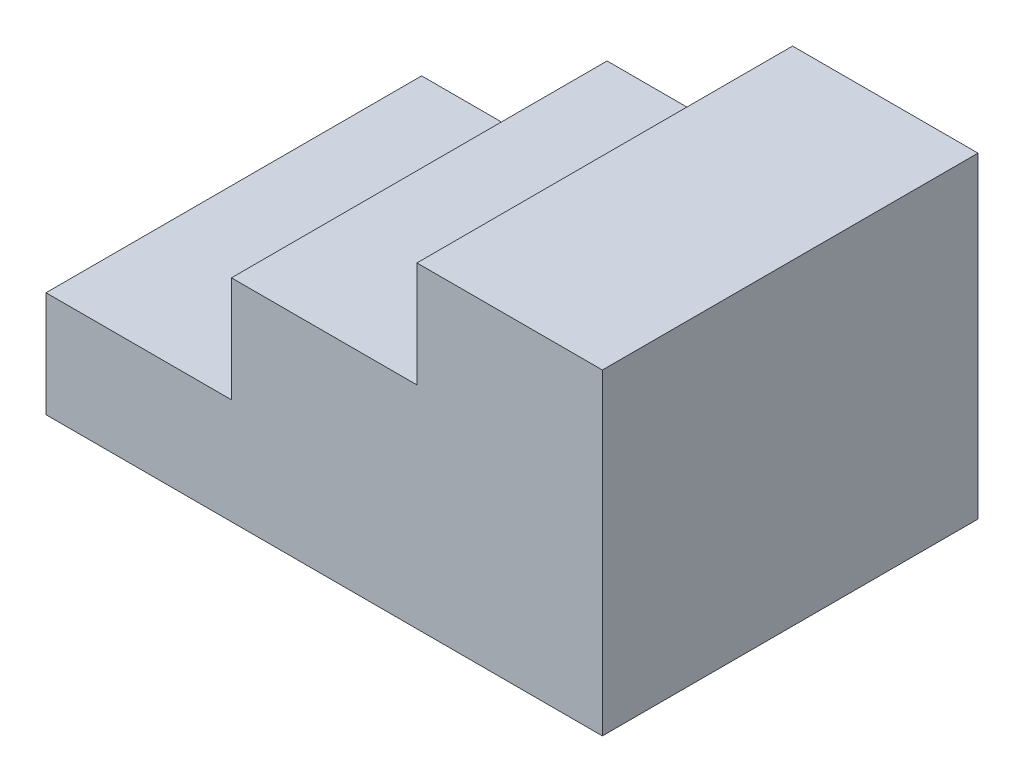
ISO-10303-21;
HEADER;
FILE_DESCRIPTION(('STEP AP214'),'2;1');
FILE_NAME('part.step','',(''),(''),'','','');
FILE_SCHEMA(('AUTOMOTIVE_DESIGN { 1 0 10303 214 1 1 1 1 }'));
ENDSEC;
DATA;
#1=APPLICATION_CONTEXT('core data for automotive mechanical design processes');
#2=APPLICATION_PROTOCOL_DEFINITION('international standard','automotive_design',2000,#1);
#3=PRODUCT_CONTEXT('',#1,'mechanical');
#4=PRODUCT('Part','Part','',(#3));
#5=PRODUCT_RELATED_PRODUCT_CATEGORY('part','',(#4));
#6=PRODUCT_DEFINITION_FORMATION('','',#4);
#7=PRODUCT_DEFINITION_CONTEXT('part definition',#1,'design');
#8=PRODUCT_DEFINITION('design','',#6,#7);
#9=PRODUCT_DEFINITION_SHAPE('','',#8);
#10=(LENGTH_UNIT() NAMED_UNIT(*) SI_UNIT(.MILLI.,.METRE.));
#11=(NAMED_UNIT(*) PLANE_ANGLE_UNIT() SI_UNIT($,.RADIAN.));
#12=(NAMED_UNIT(*) SI_UNIT($,.STERADIAN.) SOLID_ANGLE_UNIT());
#13=UNCERTAINTY_MEASURE_WITH_UNIT(LENGTH_MEASURE(1.E-05),#10,'distance_accuracy_value','');
#14=(GEOMETRIC_REPRESENTATION_CONTEXT(3) GLOBAL_UNCERTAINTY_ASSIGNED_CONTEXT((#13)) GLOBAL_UNIT_ASSIGNED_CONTEXT((#10,
#11,#12)) REPRESENTATION_CONTEXT('',''));
#15=CARTESIAN_POINT('',(0.,0.,0.));
#16=DIRECTION('',(0.,0.,1.));
#17=DIRECTION('',(1.,0.,0.));
#18=AXIS2_PLACEMENT_3D('',#15,#16,#17);
#19=CARTESIAN_POINT('',(0.,171.45,609.6));
#20=DIRECTION('',(1.,0.,0.));
#21=DIRECTION('',(0.,0.,-1.));
#22=AXIS2_PLACEMENT_3D('',#19,#20,#21);
#23=PLANE('',#22);
#24=DIRECTION('',(0.,-1.,0.));
#25=VECTOR('',#24,1.);
#26=CARTESIAN_POINT('',(0.,171.45,0.));
#27=LINE('',#26,#25);
#28=CARTESIAN_POINT('',(0.,171.45,0.));
#29=VERTEX_POINT('',#28);
#30=CARTESIAN_POINT('',(0.,0.,0.));
#31=VERTEX_POINT('',#30);
#32=EDGE_CURVE('E129',#29,#31,#27,.T.);
#33=ORIENTED_EDGE('',*,*,#32,.T.);
#34=DIRECTION('',(0.,0.,-1.));
#35=VECTOR('',#34,1.);
#36=CARTESIAN_POINT('',(0.,0.,609.6));
#37=LINE('',#36,#35);
#38=CARTESIAN_POINT('',(0.,0.,609.6));
#39=VERTEX_POINT('',#38);
#40=EDGE_CURVE('E11',#39,#31,#37,.T.);
#41=ORIENTED_EDGE('',*,*,#40,.F.);
#42=DIRECTION('',(0.,-1.,0.));
#43=VECTOR('',#42,1.);
#44=CARTESIAN_POINT('',(0.,171.45,609.6));
#45=LINE('',#44,#43);
#46=CARTESIAN_POINT('',(0.,171.45,609.6));
#47=VERTEX_POINT('',#46);
#48=EDGE_CURVE('E143',#47,#39,#45,.T.);
#49=ORIENTED_EDGE('',*,*,#48,.F.);
#50=DIRECTION('',(0.,0.,-1.));
#51=VECTOR('',#50,1.);
#52=CARTESIAN_POINT('',(0.,171.45,609.6));
#53=LINE('',#52,#51);
#54=EDGE_CURVE('E125',#47,#29,#53,.T.);
#55=ORIENTED_EDGE('',*,*,#54,.T.);
#56=EDGE_LOOP('',(#33,#41,#49,#55));
#57=FACE_BOUND('',#56,.T.);
#58=ADVANCED_FACE('F33',(#57),#23,.F.);
#59=CARTESIAN_POINT('',(0.,0.,609.6));
#60=DIRECTION('',(0.,1.,0.));
#61=DIRECTION('',(0.,0.,1.));
#62=AXIS2_PLACEMENT_3D('',#59,#60,#61);
#63=PLANE('',#62);
#64=DIRECTION('',(1.,0.,0.));
#65=VECTOR('',#64,1.);
#66=CARTESIAN_POINT('',(0.,0.,0.));
#67=LINE('',#66,#65);
#68=CARTESIAN_POINT('',(902.97,0.,0.));
#69=VERTEX_POINT('',#68);
#70=EDGE_CURVE('E132',#31,#69,#67,.T.);
#71=ORIENTED_EDGE('',*,*,#70,.T.);
#72=DIRECTION('',(0.,0.,-1.));
#73=VECTOR('',#72,1.);
#74=CARTESIAN_POINT('',(902.97,0.,609.6));
#75=LINE('',#74,#73);
#76=CARTESIAN_POINT('',(902.97,0.,609.6));
#77=VERTEX_POINT('',#76);
#78=EDGE_CURVE('E41',#77,#69,#75,.T.);
#79=ORIENTED_EDGE('',*,*,#78,.F.);
#80=DIRECTION('',(1.,0.,0.));
#81=VECTOR('',#80,1.);
#82=CARTESIAN_POINT('',(0.,0.,609.6));
#83=LINE('',#82,#81);
#84=EDGE_CURVE('E92',#39,#77,#83,.T.);
#85=ORIENTED_EDGE('',*,*,#84,.F.);
#86=ORIENTED_EDGE('',*,*,#40,.T.);
#87=EDGE_LOOP('',(#71,#79,#85,#86));
#88=FACE_BOUND('',#87,.T.);
#89=ADVANCED_FACE('F178',(#88),#63,.F.);
#90=CARTESIAN_POINT('',(902.97,0.,609.6));
#91=DIRECTION('',(-1.,0.,0.));
#92=DIRECTION('',(0.,-1.,0.));
#93=AXIS2_PLACEMENT_3D('',#90,#91,#92);
#94=PLANE('',#93);
#95=DIRECTION('',(0.,1.,0.));
#96=VECTOR('',#95,1.);
#97=CARTESIAN_POINT('',(902.97,0.,0.));
#98=LINE('',#97,#96);
#99=CARTESIAN_POINT('',(902.97,514.35,0.));
#100=VERTEX_POINT('',#99);
#101=EDGE_CURVE('E134',#69,#100,#98,.T.);
#102=ORIENTED_EDGE('',*,*,#101,.T.);
#103=DIRECTION('',(0.,0.,-1.));
#104=VECTOR('',#103,1.);
#105=CARTESIAN_POINT('',(902.97,514.35,609.6));
#106=LINE('',#105,#104);
#107=CARTESIAN_POINT('',(902.97,514.35,609.6));
#108=VERTEX_POINT('',#107);
#109=EDGE_CURVE('E150',#108,#100,#106,.T.);
#110=ORIENTED_EDGE('',*,*,#109,.F.);
#111=DIRECTION('',(0.,1.,0.));
#112=VECTOR('',#111,1.);
#113=CARTESIAN_POINT('',(902.97,0.,609.6));
#114=LINE('',#113,#112);
#115=EDGE_CURVE('E158',#77,#108,#114,.T.);
#116=ORIENTED_EDGE('',*,*,#115,.F.);
#117=ORIENTED_EDGE('',*,*,#78,.T.);
#118=EDGE_LOOP('',(#102,#110,#116,#117));
#119=FACE_BOUND('',#118,.T.);
#120=ADVANCED_FACE('F156',(#119),#94,.F.);
#121=CARTESIAN_POINT('',(902.97,514.35,609.6));
#122=DIRECTION('',(0.,-1.,0.));
#123=DIRECTION('',(1.,0.,0.));
#124=AXIS2_PLACEMENT_3D('',#121,#122,#123);
#125=PLANE('',#124);
#126=DIRECTION('',(-1.,0.,0.));
#127=VECTOR('',#126,1.);
#128=CARTESIAN_POINT('',(902.97,514.35,0.));
#129=LINE('',#128,#127);
#130=CARTESIAN_POINT('',(601.98,514.35,0.));
#131=VERTEX_POINT('',#130);
#132=EDGE_CURVE('E136',#100,#131,#129,.T.);
#133=ORIENTED_EDGE('',*,*,#132,.T.);
#134=DIRECTION('',(0.,0.,-1.));
#135=VECTOR('',#134,1.);
#136=CARTESIAN_POINT('',(601.98,514.35,609.6));
#137=LINE('',#136,#135);
#138=CARTESIAN_POINT('',(601.98,514.35,609.6));
#139=VERTEX_POINT('',#138);
#140=EDGE_CURVE('E147',#139,#131,#137,.T.);
#141=ORIENTED_EDGE('',*,*,#140,.F.);
#142=DIRECTION('',(-1.,0.,0.));
#143=VECTOR('',#142,1.);
#144=CARTESIAN_POINT('',(902.97,514.35,609.6));
#145=LINE('',#144,#143);
#146=EDGE_CURVE('E170',#108,#139,#145,.T.);
#147=ORIENTED_EDGE('',*,*,#146,.F.);
#148=ORIENTED_EDGE('',*,*,#109,.T.);
#149=EDGE_LOOP('',(#133,#141,#147,#148));
#150=FACE_BOUND('',#149,.T.);
#151=ADVANCED_FACE('F166',(#150),#125,.F.);
#152=CARTESIAN_POINT('',(601.98,514.35,609.6));
#153=DIRECTION('',(1.,0.,0.));
#154=DIRECTION('',(0.,1.,0.));
#155=AXIS2_PLACEMENT_3D('',#152,#153,#154);
#156=PLANE('',#155);
#157=DIRECTION('',(0.,-1.,0.));
#158=VECTOR('',#157,1.);
#159=CARTESIAN_POINT('',(601.98,514.35,0.));
#160=LINE('',#159,#158);
#161=CARTESIAN_POINT('',(601.98,342.9,0.));
#162=VERTEX_POINT('',#161);
#163=EDGE_CURVE('E138',#131,#162,#160,.T.);
#164=ORIENTED_EDGE('',*,*,#163,.T.);
#165=DIRECTION('',(0.,0.,-1.));
#166=VECTOR('',#165,1.);
#167=CARTESIAN_POINT('',(601.98,342.9,609.6));
#168=LINE('',#167,#166);
#169=CARTESIAN_POINT('',(601.98,342.9,609.6));
#170=VERTEX_POINT('',#169);
#171=EDGE_CURVE('E120',#170,#162,#168,.T.);
#172=ORIENTED_EDGE('',*,*,#171,.F.);
#173=DIRECTION('',(0.,-1.,0.));
#174=VECTOR('',#173,1.);
#175=CARTESIAN_POINT('',(601.98,514.35,609.6));
#176=LINE('',#175,#174);
#177=EDGE_CURVE('E111',#139,#170,#176,.T.);
#178=ORIENTED_EDGE('',*,*,#177,.F.);
#179=ORIENTED_EDGE('',*,*,#140,.T.);
#180=EDGE_LOOP('',(#164,#172,#178,#179));
#181=FACE_BOUND('',#180,.T.);
#182=ADVANCED_FACE('F169',(#181),#156,.F.);
#183=CARTESIAN_POINT('',(601.98,342.9,609.6));
#184=DIRECTION('',(0.,-1.,0.));
#185=DIRECTION('',(0.,0.,-1.));
#186=AXIS2_PLACEMENT_3D('',#183,#184,#185);
#187=PLANE('',#186);
#188=DIRECTION('',(-1.,0.,0.));
#189=VECTOR('',#188,1.);
#190=CARTESIAN_POINT('',(601.98,342.9,0.));
#191=LINE('',#190,#189);
#192=CARTESIAN_POINT('',(300.99,342.9,0.));
#193=VERTEX_POINT('',#192);
#194=EDGE_CURVE('E119',#162,#193,#191,.T.);
#195=ORIENTED_EDGE('',*,*,#194,.T.);
#196=DIRECTION('',(0.,0.,-1.));
#197=VECTOR('',#196,1.);
#198=CARTESIAN_POINT('',(300.99,342.9,609.6));
#199=LINE('',#198,#197);
#200=CARTESIAN_POINT('',(300.99,342.9,609.6));
#201=VERTEX_POINT('',#200);
#202=EDGE_CURVE('E116',#201,#193,#199,.T.);
#203=ORIENTED_EDGE('',*,*,#202,.F.);
#204=DIRECTION('',(-1.,0.,0.));
#205=VECTOR('',#204,1.);
#206=CARTESIAN_POINT('',(601.98,342.9,609.6));
#207=LINE('',#206,#205);
#208=EDGE_CURVE('E105',#170,#201,#207,.T.);
#209=ORIENTED_EDGE('',*,*,#208,.F.);
#210=ORIENTED_EDGE('',*,*,#171,.T.);
#211=EDGE_LOOP('',(#195,#203,#209,#210));
#212=FACE_BOUND('',#211,.T.);
#213=ADVANCED_FACE('F117',(#212),#187,.F.);
#214=CARTESIAN_POINT('',(300.99,342.9,609.6));
#215=DIRECTION('',(1.,0.,0.));
#216=DIRECTION('',(0.,0.,-1.));
#217=AXIS2_PLACEMENT_3D('',#214,#215,#216);
#218=PLANE('',#217);
#219=DIRECTION('',(0.,-1.,0.));
#220=VECTOR('',#219,1.);
#221=CARTESIAN_POINT('',(300.99,342.9,0.));
#222=LINE('',#221,#220);
#223=CARTESIAN_POINT('',(300.99,171.45,0.));
#224=VERTEX_POINT('',#223);
#225=EDGE_CURVE('E78',#193,#224,#222,.T.);
#226=ORIENTED_EDGE('',*,*,#225,.T.);
#227=DIRECTION('',(0.,0.,-1.));
#228=VECTOR('',#227,1.);
#229=CARTESIAN_POINT('',(300.99,171.45,609.6));
#230=LINE('',#229,#228);
#231=CARTESIAN_POINT('',(300.99,171.45,609.6));
#232=VERTEX_POINT('',#231);
#233=EDGE_CURVE('E121',#232,#224,#230,.T.);
#234=ORIENTED_EDGE('',*,*,#233,.F.);
#235=DIRECTION('',(0.,-1.,0.));
#236=VECTOR('',#235,1.);
#237=CARTESIAN_POINT('',(300.99,342.9,609.6));
#238=LINE('',#237,#236);
#239=EDGE_CURVE('E109',#201,#232,#238,.T.);
#240=ORIENTED_EDGE('',*,*,#239,.F.);
#241=ORIENTED_EDGE('',*,*,#202,.T.);
#242=EDGE_LOOP('',(#226,#234,#240,#241));
#243=FACE_BOUND('',#242,.T.);
#244=ADVANCED_FACE('F123',(#243),#218,.F.);
#245=CARTESIAN_POINT('',(300.99,171.45,609.6));
#246=DIRECTION('',(0.,-1.,0.));
#247=DIRECTION('',(0.,0.,-1.));
#248=AXIS2_PLACEMENT_3D('',#245,#246,#247);
#249=PLANE('',#248);
#250=DIRECTION('',(-1.,0.,0.));
#251=VECTOR('',#250,1.);
#252=CARTESIAN_POINT('',(300.99,171.45,0.));
#253=LINE('',#252,#251);
#254=EDGE_CURVE('E84',#224,#29,#253,.T.);
#255=ORIENTED_EDGE('',*,*,#254,.T.);
#256=ORIENTED_EDGE('',*,*,#54,.F.);
#257=DIRECTION('',(-1.,0.,0.));
#258=VECTOR('',#257,1.);
#259=CARTESIAN_POINT('',(300.99,171.45,609.6));
#260=LINE('',#259,#258);
#261=EDGE_CURVE('E49',#232,#47,#260,.T.);
#262=ORIENTED_EDGE('',*,*,#261,.F.);
#263=ORIENTED_EDGE('',*,*,#233,.T.);
#264=EDGE_LOOP('',(#255,#256,#262,#263));
#265=FACE_BOUND('',#264,.T.);
#266=ADVANCED_FACE('F194',(#265),#249,.F.);
#267=CARTESIAN_POINT('',(0.,0.,609.6));
#268=DIRECTION('',(0.,0.,1.));
#269=DIRECTION('',(1.,0.,0.));
#270=AXIS2_PLACEMENT_3D('',#267,#268,#269);
#271=PLANE('',#270);
#272=ORIENTED_EDGE('',*,*,#48,.T.);
#273=ORIENTED_EDGE('',*,*,#84,.T.);
#274=ORIENTED_EDGE('',*,*,#115,.T.);
#275=ORIENTED_EDGE('',*,*,#146,.T.);
#276=ORIENTED_EDGE('',*,*,#177,.T.);
#277=ORIENTED_EDGE('',*,*,#208,.T.);
#278=ORIENTED_EDGE('',*,*,#239,.T.);
#279=ORIENTED_EDGE('',*,*,#261,.T.);
#280=EDGE_LOOP('',(#272,#273,#274,#275,#276,#277,#278,#279));
#281=FACE_BOUND('',#280,.T.);
#282=ADVANCED_FACE('F107',(#281),#271,.T.);
#283=CARTESIAN_POINT('',(0.,0.,0.));
#284=DIRECTION('',(0.,0.,1.));
#285=DIRECTION('',(1.,0.,0.));
#286=AXIS2_PLACEMENT_3D('',#283,#284,#285);
#287=PLANE('',#286);
#288=ORIENTED_EDGE('',*,*,#32,.F.);
#289=ORIENTED_EDGE('',*,*,#254,.F.);
#290=ORIENTED_EDGE('',*,*,#225,.F.);
#291=ORIENTED_EDGE('',*,*,#194,.F.);
#292=ORIENTED_EDGE('',*,*,#163,.F.);
#293=ORIENTED_EDGE('',*,*,#132,.F.);
#294=ORIENTED_EDGE('',*,*,#101,.F.);
#295=ORIENTED_EDGE('',*,*,#70,.F.);
#296=EDGE_LOOP('',(#288,#289,#290,#291,#292,#293,#294,#295));
#297=FACE_BOUND('',#296,.T.);
#298=ADVANCED_FACE('F162',(#297),#287,.F.);
#299=CLOSED_SHELL('',(#58,#89,#120,#151,#182,#213,#244,#266,#282,#298));
#300=MANIFOLD_SOLID_BREP('B2',#299);
#301=ADVANCED_BREP_SHAPE_REPRESENTATION('',(#18,#300),#14);
#302=SHAPE_DEFINITION_REPRESENTATION(#9,#301);
ENDSEC;
END-ISO-10303-21;
